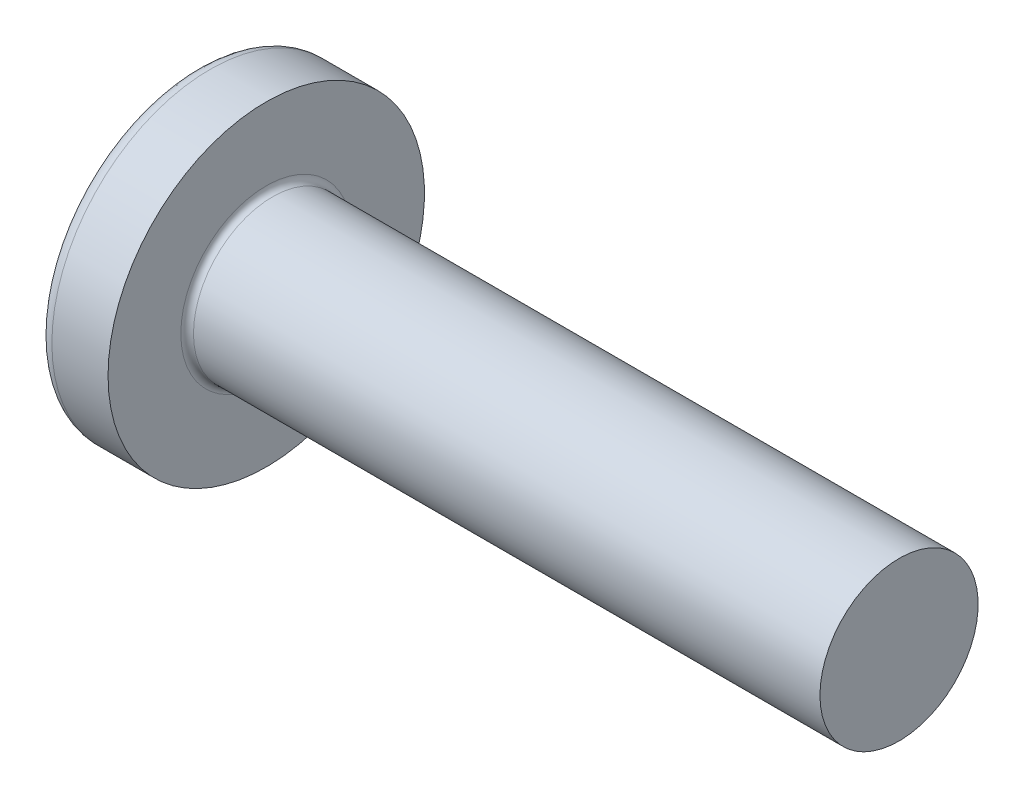
ISO-10303-21;
HEADER;
FILE_DESCRIPTION(('STEP AP214'),'2;1');
FILE_NAME('part.step','',(''),(''),'','','');
FILE_SCHEMA(('AUTOMOTIVE_DESIGN { 1 0 10303 214 1 1 1 1 }'));
ENDSEC;
DATA;
#1=APPLICATION_CONTEXT('core data for automotive mechanical design processes');
#2=APPLICATION_PROTOCOL_DEFINITION('international standard','automotive_design',2000,#1);
#3=PRODUCT_CONTEXT('',#1,'mechanical');
#4=PRODUCT('Part','Part','',(#3));
#5=PRODUCT_RELATED_PRODUCT_CATEGORY('part','',(#4));
#6=PRODUCT_DEFINITION_FORMATION('','',#4);
#7=PRODUCT_DEFINITION_CONTEXT('part definition',#1,'design');
#8=PRODUCT_DEFINITION('design','',#6,#7);
#9=PRODUCT_DEFINITION_SHAPE('','',#8);
#10=(LENGTH_UNIT() NAMED_UNIT(*) SI_UNIT(.MILLI.,.METRE.));
#11=(NAMED_UNIT(*) PLANE_ANGLE_UNIT() SI_UNIT($,.RADIAN.));
#12=(NAMED_UNIT(*) SI_UNIT($,.STERADIAN.) SOLID_ANGLE_UNIT());
#13=UNCERTAINTY_MEASURE_WITH_UNIT(LENGTH_MEASURE(1.E-05),#10,'distance_accuracy_value','');
#14=(GEOMETRIC_REPRESENTATION_CONTEXT(3) GLOBAL_UNCERTAINTY_ASSIGNED_CONTEXT((#13)) GLOBAL_UNIT_ASSIGNED_CONTEXT((#10,
#11,#12)) REPRESENTATION_CONTEXT('',''));
#15=CARTESIAN_POINT('',(0.,0.,0.));
#16=DIRECTION('',(0.,0.,1.));
#17=DIRECTION('',(1.,0.,0.));
#18=AXIS2_PLACEMENT_3D('',#15,#16,#17);
#19=CARTESIAN_POINT('',(16.,0.,0.));
#20=DIRECTION('',(-1.,0.,0.));
#21=DIRECTION('',(0.,1.,0.));
#22=AXIS2_PLACEMENT_3D('',#19,#20,#21);
#23=SPHERICAL_SURFACE('',#22,16.);
#24=CARTESIAN_POINT('',(3.23189799723057,0.,0.));
#25=DIRECTION('',(-1.,0.,0.));
#26=DIRECTION('',(0.,0.,1.));
#27=AXIS2_PLACEMENT_3D('',#24,#25,#26);
#28=CIRCLE('',#27,9.64238410596027);
#29=CARTESIAN_POINT('',(3.23189799723057,0.,9.64238410596027));
#30=VERTEX_POINT('',#29);
#31=EDGE_CURVE('E212',#30,#30,#28,.T.);
#32=ORIENTED_EDGE('',*,*,#31,.T.);
#33=EDGE_LOOP('',(#32));
#34=FACE_BOUND('',#33,.T.);
#35=CARTESIAN_POINT('',(0.168594787067849,0.,0.));
#36=DIRECTION('',(1.,0.,0.));
#37=DIRECTION('',(0.,0.,-1.));
#38=AXIS2_PLACEMENT_3D('',#35,#36,#37);
#39=CIRCLE('',#38,2.31659426398858);
#40=CARTESIAN_POINT('',(0.16859478706785,-1.07999999999999,-2.04944113941943));
#41=VERTEX_POINT('',#40);
#42=CARTESIAN_POINT('',(0.168594787067849,-2.04944113941942,-1.08));
#43=VERTEX_POINT('',#42);
#44=EDGE_CURVE('E338',#41,#43,#39,.F.);
#45=ORIENTED_EDGE('',*,*,#44,.F.);
#46=CARTESIAN_POINT('',(16.,-1.08,0.));
#47=DIRECTION('',(0.,1.,0.));
#48=DIRECTION('',(0.,0.,1.));
#49=AXIS2_PLACEMENT_3D('',#46,#47,#48);
#50=CIRCLE('',#49,15.9635083863166);
#51=CARTESIAN_POINT('',(0.712098426985781,-1.07999999999998,-4.59496088055484));
#52=VERTEX_POINT('',#51);
#53=EDGE_CURVE('E272',#52,#41,#50,.T.);
#54=ORIENTED_EDGE('',*,*,#53,.F.);
#55=CARTESIAN_POINT('',(14.7911437269581,0.,2.42459099107232));
#56=DIRECTION('',(0.446197753347436,0.,-0.894934391398443));
#57=DIRECTION('',(-0.894934391398443,0.,-0.446197753347436));
#58=AXIS2_PLACEMENT_3D('',#55,#56,#57);
#59=CIRCLE('',#58,15.7689576395251);
#60=CARTESIAN_POINT('',(0.712098426985781,1.08000000000002,-4.59496088055483));
#61=VERTEX_POINT('',#60);
#62=EDGE_CURVE('E246',#52,#61,#59,.T.);
#63=ORIENTED_EDGE('',*,*,#62,.T.);
#64=CARTESIAN_POINT('',(16.,1.08,0.));
#65=DIRECTION('',(0.,-1.,0.));
#66=DIRECTION('',(0.,0.,-1.));
#67=AXIS2_PLACEMENT_3D('',#64,#65,#66);
#68=CIRCLE('',#67,15.9635083863166);
#69=CARTESIAN_POINT('',(0.16859478706785,1.08000000000001,-2.04944113941942));
#70=VERTEX_POINT('',#69);
#71=EDGE_CURVE('E300',#70,#61,#68,.T.);
#72=ORIENTED_EDGE('',*,*,#71,.F.);
#73=CARTESIAN_POINT('',(0.168594787067849,2.04944113941941,-1.08));
#74=VERTEX_POINT('',#73);
#75=EDGE_CURVE('E353',#74,#70,#39,.F.);
#76=ORIENTED_EDGE('',*,*,#75,.F.);
#77=CARTESIAN_POINT('',(16.,0.,-1.08));
#78=DIRECTION('',(0.,0.,1.));
#79=DIRECTION('',(1.,0.,0.));
#80=AXIS2_PLACEMENT_3D('',#77,#78,#79);
#81=CIRCLE('',#80,15.9635083863166);
#82=CARTESIAN_POINT('',(0.71209842698578,4.59496088055484,-1.08));
#83=VERTEX_POINT('',#82);
#84=EDGE_CURVE('E240',#83,#74,#81,.T.);
#85=ORIENTED_EDGE('',*,*,#84,.F.);
#86=CARTESIAN_POINT('',(14.7911437269581,-2.42459099107232,0.));
#87=DIRECTION('',(0.446197753347436,0.894934391398443,0.));
#88=DIRECTION('',(-0.894934391398443,0.446197753347436,0.));
#89=AXIS2_PLACEMENT_3D('',#86,#87,#88);
#90=CIRCLE('',#89,15.7689576395251);
#91=CARTESIAN_POINT('',(0.71209842698578,4.59496088055484,1.08));
#92=VERTEX_POINT('',#91);
#93=EDGE_CURVE('E243',#83,#92,#90,.T.);
#94=ORIENTED_EDGE('',*,*,#93,.T.);
#95=CARTESIAN_POINT('',(16.,0.,1.08));
#96=DIRECTION('',(0.,0.,-1.));
#97=DIRECTION('',(0.,1.,0.));
#98=AXIS2_PLACEMENT_3D('',#95,#96,#97);
#99=CIRCLE('',#98,15.9635083863166);
#100=CARTESIAN_POINT('',(0.168594787067849,2.04944113941941,1.08));
#101=VERTEX_POINT('',#100);
#102=EDGE_CURVE('E236',#101,#92,#99,.T.);
#103=ORIENTED_EDGE('',*,*,#102,.F.);
#104=CARTESIAN_POINT('',(0.16859478706785,1.07999999999999,2.04944113941943));
#105=VERTEX_POINT('',#104);
#106=EDGE_CURVE('E352',#105,#101,#39,.F.);
#107=ORIENTED_EDGE('',*,*,#106,.F.);
#108=CARTESIAN_POINT('',(0.712098426985781,1.07999999999998,4.59496088055484));
#109=VERTEX_POINT('',#108);
#110=EDGE_CURVE('E256',#109,#105,#68,.T.);
#111=ORIENTED_EDGE('',*,*,#110,.F.);
#112=CARTESIAN_POINT('',(14.7911437269581,0.,-2.42459099107232));
#113=DIRECTION('',(0.446197753347436,0.,0.894934391398443));
#114=DIRECTION('',(0.894934391398443,0.,-0.446197753347436));
#115=AXIS2_PLACEMENT_3D('',#112,#113,#114);
#116=CIRCLE('',#115,15.7689576395251);
#117=CARTESIAN_POINT('',(0.712098426985781,-1.08000000000002,4.59496088055483));
#118=VERTEX_POINT('',#117);
#119=EDGE_CURVE('E47',#109,#118,#116,.T.);
#120=ORIENTED_EDGE('',*,*,#119,.T.);
#121=CARTESIAN_POINT('',(0.16859478706785,-1.08000000000001,2.04944113941943));
#122=VERTEX_POINT('',#121);
#123=EDGE_CURVE('E253',#122,#118,#50,.T.);
#124=ORIENTED_EDGE('',*,*,#123,.F.);
#125=CARTESIAN_POINT('',(0.168594787067849,-2.04944113941942,1.08));
#126=VERTEX_POINT('',#125);
#127=EDGE_CURVE('E384',#126,#122,#39,.F.);
#128=ORIENTED_EDGE('',*,*,#127,.F.);
#129=CARTESIAN_POINT('',(0.71209842698578,-4.59496088055483,1.08));
#130=VERTEX_POINT('',#129);
#131=EDGE_CURVE('E237',#130,#126,#99,.T.);
#132=ORIENTED_EDGE('',*,*,#131,.F.);
#133=CARTESIAN_POINT('',(14.7911437269581,2.42459099107232,0.));
#134=DIRECTION('',(0.446197753347436,-0.894934391398443,0.));
#135=DIRECTION('',(0.894934391398443,0.446197753347436,0.));
#136=AXIS2_PLACEMENT_3D('',#133,#134,#135);
#137=CIRCLE('',#136,15.7689576395251);
#138=CARTESIAN_POINT('',(0.71209842698578,-4.59496088055484,-1.08));
#139=VERTEX_POINT('',#138);
#140=EDGE_CURVE('E233',#130,#139,#137,.T.);
#141=ORIENTED_EDGE('',*,*,#140,.T.);
#142=EDGE_CURVE('E62',#43,#139,#81,.T.);
#143=ORIENTED_EDGE('',*,*,#142,.F.);
#144=EDGE_LOOP('',(#45,#54,#63,#72,#76,#85,#94,#103,#107,#111,#120,#124,#128,#132,#141,#143));
#145=FACE_BOUND('',#144,.T.);
#146=ADVANCED_FACE('F34',(#34,#145),#23,.T.);
#147=CARTESIAN_POINT('',(0.,4.94999999999999,-1.08));
#148=DIRECTION('',(0.,0.,1.));
#149=DIRECTION('',(1.,0.,0.));
#150=AXIS2_PLACEMENT_3D('',#147,#148,#149);
#151=PLANE('',#150);
#152=ORIENTED_EDGE('',*,*,#84,.T.);
#153=CARTESIAN_POINT('',(-3.43605311056389,2.33057774319368,-1.08));
#154=CARTESIAN_POINT('',(-2.73005788936149,2.27615518507628,-1.08));
#155=CARTESIAN_POINT('',(-2.02408650858328,2.22141913982355,-1.08));
#156=CARTESIAN_POINT('',(-0.612196178896327,2.11110719124856,-1.08));
#157=CARTESIAN_POINT('',(0.0937227687909008,2.05553127230215,-1.08));
#158=CARTESIAN_POINT('',(1.15253879223642,1.97137932907642,-1.08));
#159=CARTESIAN_POINT('',(1.50546717443926,1.94319732850324,-1.08));
#160=CARTESIAN_POINT('',(2.21129884226403,1.88653195912772,-1.08));
#161=CARTESIAN_POINT('',(2.56420212794819,1.85804859110097,-1.08));
#162=CARTESIAN_POINT('',(3.26997437360886,1.80073759682966,-1.08));
#163=CARTESIAN_POINT('',(3.62284333408858,1.77190997678611,-1.08));
#164=CARTESIAN_POINT('',(4.32855163516413,1.71385567830055,-1.08));
#165=CARTESIAN_POINT('',(4.68139097546501,1.68462899627166,-1.08));
#166=CARTESIAN_POINT('',(5.48196138691584,1.61778484426536,-1.08));
#167=CARTESIAN_POINT('',(5.92968063936628,1.5800255789917,-1.08));
#168=CARTESIAN_POINT('',(6.82503914618352,1.50358396776163,-1.08));
#169=CARTESIAN_POINT('',(7.27267840078262,1.46490162453115,-1.08));
#170=CARTESIAN_POINT('',(8.16783657307055,1.38637288862663,-1.08));
#171=CARTESIAN_POINT('',(8.6153554949306,1.34652654360286,-1.08));
#172=CARTESIAN_POINT('',(9.51026248486919,1.26532289179753,-1.08));
#173=CARTESIAN_POINT('',(9.95765055123334,1.22396556604181,-1.08));
#174=CARTESIAN_POINT('',(10.8523158736642,1.13920912306466,-1.08));
#175=CARTESIAN_POINT('',(11.2995930947875,1.09580963592832,-1.08));
#176=CARTESIAN_POINT('',(12.1938496891445,1.00615798148881,-1.08));
#177=CARTESIAN_POINT('',(12.6408290721386,0.959905912835485,-1.08));
#178=CARTESIAN_POINT('',(13.3109832262361,0.887238538031377,-1.08));
#179=CARTESIAN_POINT('',(13.5343356366705,0.862465479305158,-1.08));
#180=CARTESIAN_POINT('',(13.9808744583761,0.811493247434636,-1.08));
#181=CARTESIAN_POINT('',(14.204060872408,0.785294098569612,-1.08));
#182=CARTESIAN_POINT('',(14.6502320441495,0.730995725435139,-1.08));
#183=CARTESIAN_POINT('',(14.8732167746121,0.702896274763054,-1.08));
#184=CARTESIAN_POINT('',(15.2074339176581,0.658726299947166,-1.08));
#185=CARTESIAN_POINT('',(15.3187994773757,0.643665717094798,-1.08));
#186=CARTESIAN_POINT('',(15.5414149899271,0.612700054932443,-1.08));
#187=CARTESIAN_POINT('',(15.6526649406011,0.596794960123566,-1.08));
#188=CARTESIAN_POINT('',(15.7638416271016,0.580382331183072,-1.08));
#189=B_SPLINE_CURVE_WITH_KNOTS('',3,(#153,#154,#155,#156,#157,#158,#159,#160,#161,#162,#163,
#164,#165,#166,#167,#168,#169,#170,#171,#172,#173,#174,#175,#176,#177,#178,#179,#180,#181,#182,
#183,#184,#185,#186,#187,#188),.UNSPECIFIED.,.F.,.F.,(4,2,2,2,2,2,2,2,2,2,2,2,2,2,2,2,2,4),(0.,
2.12426964290659,4.24857885235091,5.3107341035929,6.37288662197896,7.43502003656715,
8.49716300414631,9.84508827634153,11.1930095684778,12.5408757584157,13.8887588800163,
15.2368871027213,16.5849687296847,17.2591314568035,17.9332827098455,18.6075144234906,
18.9446495011757,19.2817907682658),.UNSPECIFIED.);
#190=CARTESIAN_POINT('',(5.69,1.60013444747621,-1.08));
#191=VERTEX_POINT('',#190);
#192=EDGE_CURVE('E373',#74,#191,#189,.T.);
#193=ORIENTED_EDGE('',*,*,#192,.T.);
#194=DIRECTION('',(0.,1.,0.));
#195=VECTOR('',#194,1.);
#196=CARTESIAN_POINT('',(5.69,-2.11307112459984,-1.08));
#197=LINE('',#196,#195);
#198=CARTESIAN_POINT('',(5.69,2.11307112459984,-1.08));
#199=VERTEX_POINT('',#198);
#200=EDGE_CURVE('E321',#191,#199,#197,.T.);
#201=ORIENTED_EDGE('',*,*,#200,.T.);
#202=DIRECTION('',(0.894934391398442,-0.446197753347436,0.));
#203=VECTOR('',#202,1.);
#204=CARTESIAN_POINT('',(0.,4.95,-1.08));
#205=LINE('',#204,#203);
#206=EDGE_CURVE('E213',#83,#199,#205,.T.);
#207=ORIENTED_EDGE('',*,*,#206,.F.);
#208=EDGE_LOOP('',(#152,#193,#201,#207));
#209=FACE_BOUND('',#208,.T.);
#210=ADVANCED_FACE('F168',(#209),#151,.T.);
#211=CARTESIAN_POINT('',(5.69,-2.11307112459984,-1.08));
#212=VERTEX_POINT('',#211);
#213=CARTESIAN_POINT('',(5.69,-1.60013444747621,-1.08));
#214=VERTEX_POINT('',#213);
#215=EDGE_CURVE('E221',#212,#214,#197,.T.);
#216=ORIENTED_EDGE('',*,*,#215,.T.);
#217=CARTESIAN_POINT('',(-3.43605311056389,-2.33057774319368,-1.08));
#218=CARTESIAN_POINT('',(-2.73005788936149,-2.27615518507628,-1.08));
#219=CARTESIAN_POINT('',(-2.02408650858328,-2.22141913982355,-1.08));
#220=CARTESIAN_POINT('',(-0.612196178896327,-2.11110719124856,-1.08));
#221=CARTESIAN_POINT('',(0.0937227687909011,-2.05553127230214,-1.08));
#222=CARTESIAN_POINT('',(1.15253879223642,-1.97137932907642,-1.08));
#223=CARTESIAN_POINT('',(1.50546717443926,-1.94319732850324,-1.08));
#224=CARTESIAN_POINT('',(2.21129884226403,-1.88653195912772,-1.08));
#225=CARTESIAN_POINT('',(2.56420212794819,-1.85804859110097,-1.08));
#226=CARTESIAN_POINT('',(3.26997437360886,-1.80073759682966,-1.08));
#227=CARTESIAN_POINT('',(3.62284333408858,-1.77190997678611,-1.08));
#228=CARTESIAN_POINT('',(4.32855163516413,-1.71385567830055,-1.08));
#229=CARTESIAN_POINT('',(4.68139097546501,-1.68462899627166,-1.08));
#230=CARTESIAN_POINT('',(5.48196138691584,-1.61778484426536,-1.08));
#231=CARTESIAN_POINT('',(5.92968063936628,-1.5800255789917,-1.08));
#232=CARTESIAN_POINT('',(6.82503914618352,-1.50358396776163,-1.08));
#233=CARTESIAN_POINT('',(7.27267840078262,-1.46490162453115,-1.08));
#234=CARTESIAN_POINT('',(8.16783657307055,-1.38637288862663,-1.08));
#235=CARTESIAN_POINT('',(8.6153554949306,-1.34652654360286,-1.08));
#236=CARTESIAN_POINT('',(9.51026248486919,-1.26532289179753,-1.08));
#237=CARTESIAN_POINT('',(9.95765055123334,-1.22396556604181,-1.08));
#238=CARTESIAN_POINT('',(10.8523158736642,-1.13920912306466,-1.08));
#239=CARTESIAN_POINT('',(11.2995930947875,-1.09580963592832,-1.08));
#240=CARTESIAN_POINT('',(12.1938496891445,-1.00615798148881,-1.08));
#241=CARTESIAN_POINT('',(12.6408290721386,-0.959905912835485,-1.08));
#242=CARTESIAN_POINT('',(13.3109832262361,-0.887238538031376,-1.08));
#243=CARTESIAN_POINT('',(13.5343356366705,-0.862465479305157,-1.08));
#244=CARTESIAN_POINT('',(13.9808744583761,-0.811493247434636,-1.08));
#245=CARTESIAN_POINT('',(14.204060872408,-0.785294098569612,-1.08));
#246=CARTESIAN_POINT('',(14.6502320441495,-0.730995725435139,-1.08));
#247=CARTESIAN_POINT('',(14.8732167746121,-0.702896274763054,-1.08));
#248=CARTESIAN_POINT('',(15.2074339176582,-0.658726299947166,-1.08));
#249=CARTESIAN_POINT('',(15.3187994773757,-0.643665717094798,-1.08));
#250=CARTESIAN_POINT('',(15.5414149899271,-0.612700054932442,-1.08));
#251=CARTESIAN_POINT('',(15.6526649406011,-0.596794960123565,-1.08));
#252=CARTESIAN_POINT('',(15.7638416271017,-0.58038233118307,-1.08));
#253=B_SPLINE_CURVE_WITH_KNOTS('',3,(#217,#218,#219,#220,#221,#222,#223,#224,#225,#226,#227,
#228,#229,#230,#231,#232,#233,#234,#235,#236,#237,#238,#239,#240,#241,#242,#243,#244,#245,#246,
#247,#248,#249,#250,#251,#252),.UNSPECIFIED.,.F.,.F.,(4,2,2,2,2,2,2,2,2,2,2,2,2,2,2,2,2,4),(0.,
2.12426964290659,4.24857885235091,5.3107341035929,6.37288662197896,7.43502003656715,
8.49716300414631,9.84508827634152,11.1930095684778,12.5408757584157,13.8887588800163,
15.2368871027213,16.5849687296847,17.2591314568035,17.9332827098455,18.6075144234906,
18.9446495011757,19.2817907682658),.UNSPECIFIED.);
#254=EDGE_CURVE('E351',#214,#43,#253,.F.);
#255=ORIENTED_EDGE('',*,*,#254,.T.);
#256=ORIENTED_EDGE('',*,*,#142,.T.);
#257=DIRECTION('',(0.894934391398442,0.446197753347436,0.));
#258=VECTOR('',#257,1.);
#259=CARTESIAN_POINT('',(0.,-4.95,-1.08));
#260=LINE('',#259,#258);
#261=EDGE_CURVE('E303',#139,#212,#260,.T.);
#262=ORIENTED_EDGE('',*,*,#261,.T.);
#263=EDGE_LOOP('',(#216,#255,#256,#262));
#264=FACE_BOUND('',#263,.T.);
#265=ADVANCED_FACE('F174',(#264),#151,.T.);
#266=CARTESIAN_POINT('',(0.,-4.94999999999999,1.08));
#267=DIRECTION('',(0.,0.,-1.));
#268=DIRECTION('',(0.,1.,0.));
#269=AXIS2_PLACEMENT_3D('',#266,#267,#268);
#270=PLANE('',#269);
#271=DIRECTION('',(0.,-1.,0.));
#272=VECTOR('',#271,1.);
#273=CARTESIAN_POINT('',(5.69,2.11307112459984,1.08));
#274=LINE('',#273,#272);
#275=CARTESIAN_POINT('',(5.69,2.11307112459984,1.08));
#276=VERTEX_POINT('',#275);
#277=CARTESIAN_POINT('',(5.69,1.60013444747621,1.08));
#278=VERTEX_POINT('',#277);
#279=EDGE_CURVE('E311',#276,#278,#274,.T.);
#280=ORIENTED_EDGE('',*,*,#279,.T.);
#281=CARTESIAN_POINT('',(-3.43605312354531,2.33057774419416,1.08));
#282=CARTESIAN_POINT('',(-2.73005790068362,2.27615518595292,1.08));
#283=CARTESIAN_POINT('',(-2.02408651824618,2.22141914057536,1.08));
#284=CARTESIAN_POINT('',(-0.612196185240834,2.11110719174749,1.08));
#285=CARTESIAN_POINT('',(0.0937227641055553,2.055531272673,1.08));
#286=CARTESIAN_POINT('',(1.15253879056997,1.97137932920962,1.08));
#287=CARTESIAN_POINT('',(1.50546717413264,1.94319732852816,1.08));
#288=CARTESIAN_POINT('',(2.21129884467686,1.88653195893371,1.08));
#289=CARTESIAN_POINT('',(2.56420213172064,1.85804859079632,1.08));
#290=CARTESIAN_POINT('',(3.26997438010022,1.80073759630085,1.08));
#291=CARTESIAN_POINT('',(3.62284334193923,1.77190997614379,1.08));
#292=CARTESIAN_POINT('',(4.32855164573311,1.7138556774276,1.08));
#293=CARTESIAN_POINT('',(4.68139098739302,1.68462899528161,1.08));
#294=CARTESIAN_POINT('',(5.48196140020257,1.61778484314849,1.08));
#295=CARTESIAN_POINT('',(5.92968065265283,1.58002557786661,1.08));
#296=CARTESIAN_POINT('',(6.82503915946948,1.50358396661807,1.08));
#297=CARTESIAN_POINT('',(7.27267841406819,1.46490162337736,1.08));
#298=CARTESIAN_POINT('',(8.16783658635485,1.38637288744954,1.08));
#299=CARTESIAN_POINT('',(8.61535550821404,1.34652654241272,1.08));
#300=CARTESIAN_POINT('',(9.51026249815054,1.26532289057715,1.08));
#301=CARTESIAN_POINT('',(9.95765056451348,1.22396556480425,1.08));
#302=CARTESIAN_POINT('',(10.8523158869419,1.13920912178625,1.08));
#303=CARTESIAN_POINT('',(11.299593108064,1.09580963462624,1.08));
#304=CARTESIAN_POINT('',(12.1938497024173,1.0061579801289,1.08));
#305=CARTESIAN_POINT('',(12.6408290854088,0.959905911441418,1.08));
#306=CARTESIAN_POINT('',(13.3109832395008,0.887238536570858,1.08));
#307=CARTESIAN_POINT('',(13.5343356499334,0.862465477819925,1.08));
#308=CARTESIAN_POINT('',(13.9808744716342,0.811493245892373,1.08));
#309=CARTESIAN_POINT('',(14.2040608856631,0.785294096995033,1.08));
#310=CARTESIAN_POINT('',(14.6502320573974,0.730995723784125,1.08));
#311=CARTESIAN_POINT('',(14.8732167878556,0.702896273067916,1.08));
#312=CARTESIAN_POINT('',(15.2074339308928,0.658726298170583,1.08));
#313=CARTESIAN_POINT('',(15.318799490607,0.643665715288515,1.08));
#314=CARTESIAN_POINT('',(15.5414150031506,0.612700053059412,1.08));
#315=CARTESIAN_POINT('',(15.65266495382,0.596794958213487,1.08));
#316=CARTESIAN_POINT('',(15.7638416403152,0.580382329231145,1.08));
#317=B_SPLINE_CURVE_WITH_KNOTS('',3,(#281,#282,#283,#284,#285,#286,#287,#288,#289,#290,#291,
#292,#293,#294,#295,#296,#297,#298,#299,#300,#301,#302,#303,#304,#305,#306,#307,#308,#309,#310,
#311,#312,#313,#314,#315,#316),.UNSPECIFIED.,.F.,.F.,(4,2,2,2,2,2,2,2,2,2,2,2,2,2,2,2,2,4),(0.,
2.12426964789832,4.24857886233492,5.3107341176693,6.37288664014772,7.43502005882796,
8.49716303049931,9.84508830269604,11.1930095948338,12.5408757847726,13.8887589063742,
15.2368871290825,16.5849687560486,17.25913148317,17.9332827362145,18.607514449863,
18.9446495275502,19.2817907946425),.UNSPECIFIED.);
#318=EDGE_CURVE('E277',#278,#101,#317,.F.);
#319=ORIENTED_EDGE('',*,*,#318,.T.);
#320=ORIENTED_EDGE('',*,*,#102,.T.);
#321=DIRECTION('',(0.894934391398442,-0.446197753347436,0.));
#322=VECTOR('',#321,1.);
#323=CARTESIAN_POINT('',(0.,4.95,1.08));
#324=LINE('',#323,#322);
#325=EDGE_CURVE('E218',#92,#276,#324,.T.);
#326=ORIENTED_EDGE('',*,*,#325,.T.);
#327=EDGE_LOOP('',(#280,#319,#320,#326));
#328=FACE_BOUND('',#327,.T.);
#329=ADVANCED_FACE('F369',(#328),#270,.T.);
#330=ORIENTED_EDGE('',*,*,#131,.T.);
#331=CARTESIAN_POINT('',(-3.43605312354531,-2.33057774419416,1.08));
#332=CARTESIAN_POINT('',(-2.73005790068362,-2.27615518595292,1.08));
#333=CARTESIAN_POINT('',(-2.02408651824618,-2.22141914057536,1.08));
#334=CARTESIAN_POINT('',(-0.612196185240835,-2.11110719174749,1.08));
#335=CARTESIAN_POINT('',(0.0937227641055548,-2.055531272673,1.08));
#336=CARTESIAN_POINT('',(1.15253879056997,-1.97137932920962,1.08));
#337=CARTESIAN_POINT('',(1.50546717413264,-1.94319732852816,1.08));
#338=CARTESIAN_POINT('',(2.21129884467686,-1.88653195893371,1.08));
#339=CARTESIAN_POINT('',(2.56420213172064,-1.85804859079632,1.08));
#340=CARTESIAN_POINT('',(3.26997438010022,-1.80073759630085,1.08));
#341=CARTESIAN_POINT('',(3.62284334193923,-1.77190997614379,1.08));
#342=CARTESIAN_POINT('',(4.32855164573311,-1.7138556774276,1.08));
#343=CARTESIAN_POINT('',(4.68139098739302,-1.68462899528161,1.08));
#344=CARTESIAN_POINT('',(5.48196140020257,-1.61778484314849,1.08));
#345=CARTESIAN_POINT('',(5.92968065265283,-1.58002557786661,1.08));
#346=CARTESIAN_POINT('',(6.82503915946948,-1.50358396661807,1.08));
#347=CARTESIAN_POINT('',(7.27267841406818,-1.46490162337736,1.08));
#348=CARTESIAN_POINT('',(8.16783658635484,-1.38637288744954,1.08));
#349=CARTESIAN_POINT('',(8.61535550821403,-1.34652654241272,1.08));
#350=CARTESIAN_POINT('',(9.51026249815053,-1.26532289057715,1.08));
#351=CARTESIAN_POINT('',(9.95765056451346,-1.22396556480425,1.08));
#352=CARTESIAN_POINT('',(10.8523158869419,-1.13920912178625,1.08));
#353=CARTESIAN_POINT('',(11.299593108064,-1.09580963462624,1.08));
#354=CARTESIAN_POINT('',(12.1938497024173,-1.0061579801289,1.08));
#355=CARTESIAN_POINT('',(12.6408290854088,-0.959905911441419,1.08));
#356=CARTESIAN_POINT('',(13.3109832395008,-0.887238536570858,1.08));
#357=CARTESIAN_POINT('',(13.5343356499334,-0.862465477819925,1.08));
#358=CARTESIAN_POINT('',(13.9808744716342,-0.811493245892374,1.08));
#359=CARTESIAN_POINT('',(14.2040608856631,-0.785294096995035,1.08));
#360=CARTESIAN_POINT('',(14.6502320573974,-0.730995723784126,1.08));
#361=CARTESIAN_POINT('',(14.8732167878556,-0.702896273067916,1.08));
#362=CARTESIAN_POINT('',(15.2074339308928,-0.658726298170583,1.08));
#363=CARTESIAN_POINT('',(15.318799490607,-0.643665715288516,1.08));
#364=CARTESIAN_POINT('',(15.5414150031506,-0.612700053059414,1.08));
#365=CARTESIAN_POINT('',(15.65266495382,-0.596794958213489,1.08));
#366=CARTESIAN_POINT('',(15.7638416403152,-0.580382329231146,1.08));
#367=B_SPLINE_CURVE_WITH_KNOTS('',3,(#331,#332,#333,#334,#335,#336,#337,#338,#339,#340,#341,
#342,#343,#344,#345,#346,#347,#348,#349,#350,#351,#352,#353,#354,#355,#356,#357,#358,#359,#360,
#361,#362,#363,#364,#365,#366),.UNSPECIFIED.,.F.,.F.,(4,2,2,2,2,2,2,2,2,2,2,2,2,2,2,2,2,4),(0.,
2.12426964789832,4.24857886233492,5.31073411766931,6.37288664014773,7.43502005882796,
8.49716303049931,9.84508830269603,11.1930095948338,12.5408757847726,13.8887589063742,
15.2368871290825,16.5849687560486,17.25913148317,17.9332827362145,18.607514449863,
18.9446495275502,19.2817907946425),.UNSPECIFIED.);
#368=CARTESIAN_POINT('',(5.69,-1.60013444747621,1.08));
#369=VERTEX_POINT('',#368);
#370=EDGE_CURVE('E385',#126,#369,#367,.T.);
#371=ORIENTED_EDGE('',*,*,#370,.T.);
#372=CARTESIAN_POINT('',(5.69,-2.11307112459984,1.08));
#373=VERTEX_POINT('',#372);
#374=EDGE_CURVE('E313',#369,#373,#274,.T.);
#375=ORIENTED_EDGE('',*,*,#374,.T.);
#376=DIRECTION('',(0.894934391398442,0.446197753347436,0.));
#377=VECTOR('',#376,1.);
#378=CARTESIAN_POINT('',(0.,-4.95,1.08));
#379=LINE('',#378,#377);
#380=EDGE_CURVE('E305',#130,#373,#379,.T.);
#381=ORIENTED_EDGE('',*,*,#380,.F.);
#382=EDGE_LOOP('',(#330,#371,#375,#381));
#383=FACE_BOUND('',#382,.T.);
#384=ADVANCED_FACE('F414',(#383),#270,.T.);
#385=CARTESIAN_POINT('',(5.69,2.11307112459984,-1.08));
#386=DIRECTION('',(-1.,0.,0.));
#387=DIRECTION('',(0.,0.,1.));
#388=AXIS2_PLACEMENT_3D('',#385,#386,#387);
#389=PLANE('',#388);
#390=ORIENTED_EDGE('',*,*,#374,.F.);
#391=CARTESIAN_POINT('',(5.69,0.,0.));
#392=DIRECTION('',(-1.,0.,0.));
#393=DIRECTION('',(0.,0.,1.));
#394=AXIS2_PLACEMENT_3D('',#391,#392,#393);
#395=CIRCLE('',#394,1.9305);
#396=EDGE_CURVE('E346',#214,#369,#395,.T.);
#397=ORIENTED_EDGE('',*,*,#396,.F.);
#398=ORIENTED_EDGE('',*,*,#215,.F.);
#399=DIRECTION('',(0.,0.,1.));
#400=VECTOR('',#399,1.);
#401=CARTESIAN_POINT('',(5.69,-2.11307112459984,-1.08));
#402=LINE('',#401,#400);
#403=EDGE_CURVE('E308',#212,#373,#402,.T.);
#404=ORIENTED_EDGE('',*,*,#403,.T.);
#405=EDGE_LOOP('',(#390,#397,#398,#404));
#406=FACE_BOUND('',#405,.T.);
#407=ADVANCED_FACE('F407',(#406),#389,.T.);
#408=DIRECTION('',(0.,0.,-1.));
#409=VECTOR('',#408,1.);
#410=CARTESIAN_POINT('',(5.69,-1.08000000000001,2.11307112459984));
#411=LINE('',#410,#409);
#412=CARTESIAN_POINT('',(5.69,-1.07999999999999,-1.60013444747621));
#413=VERTEX_POINT('',#412);
#414=CARTESIAN_POINT('',(5.69,-1.07999999999999,-2.11307112459984));
#415=VERTEX_POINT('',#414);
#416=EDGE_CURVE('E294',#413,#415,#411,.T.);
#417=ORIENTED_EDGE('',*,*,#416,.F.);
#418=CARTESIAN_POINT('',(5.69,1.08000000000001,-1.60013444747621));
#419=VERTEX_POINT('',#418);
#420=EDGE_CURVE('E54',#419,#413,#395,.T.);
#421=ORIENTED_EDGE('',*,*,#420,.F.);
#422=DIRECTION('',(0.,0.,1.));
#423=VECTOR('',#422,1.);
#424=CARTESIAN_POINT('',(5.69,1.08000000000001,-2.11307112459984));
#425=LINE('',#424,#423);
#426=CARTESIAN_POINT('',(5.69,1.08000000000001,-2.11307112459984));
#427=VERTEX_POINT('',#426);
#428=EDGE_CURVE('E297',#427,#419,#425,.T.);
#429=ORIENTED_EDGE('',*,*,#428,.F.);
#430=DIRECTION('',(0.,-1.,0.));
#431=VECTOR('',#430,1.);
#432=CARTESIAN_POINT('',(5.69,1.08000000000001,-2.11307112459984));
#433=LINE('',#432,#431);
#434=EDGE_CURVE('E288',#427,#415,#433,.T.);
#435=ORIENTED_EDGE('',*,*,#434,.T.);
#436=EDGE_LOOP('',(#417,#421,#429,#435));
#437=FACE_BOUND('',#436,.T.);
#438=ADVANCED_FACE('F341',(#437),#389,.T.);
#439=ORIENTED_EDGE('',*,*,#200,.F.);
#440=EDGE_CURVE('E345',#278,#191,#395,.T.);
#441=ORIENTED_EDGE('',*,*,#440,.F.);
#442=ORIENTED_EDGE('',*,*,#279,.F.);
#443=DIRECTION('',(0.,0.,-1.));
#444=VECTOR('',#443,1.);
#445=CARTESIAN_POINT('',(5.69,2.11307112459984,1.08));
#446=LINE('',#445,#444);
#447=EDGE_CURVE('E314',#276,#199,#446,.T.);
#448=ORIENTED_EDGE('',*,*,#447,.T.);
#449=EDGE_LOOP('',(#439,#441,#442,#448));
#450=FACE_BOUND('',#449,.T.);
#451=ADVANCED_FACE('F408',(#450),#389,.T.);
#452=CARTESIAN_POINT('',(0.,1.07999999999998,4.95));
#453=DIRECTION('',(0.,-1.,0.));
#454=DIRECTION('',(1.,0.,0.));
#455=AXIS2_PLACEMENT_3D('',#452,#453,#454);
#456=PLANE('',#455);
#457=ORIENTED_EDGE('',*,*,#110,.T.);
#458=CARTESIAN_POINT('',(-3.43605312354531,1.07999999999999,2.33057774419416));
#459=CARTESIAN_POINT('',(-2.73005790068362,1.07999999999999,2.27615518595292));
#460=CARTESIAN_POINT('',(-2.02408651824618,1.07999999999999,2.22141914057537));
#461=CARTESIAN_POINT('',(-0.612196185240833,1.07999999999999,2.11110719174749));
#462=CARTESIAN_POINT('',(0.0937227641055562,1.07999999999999,2.05553127267301));
#463=CARTESIAN_POINT('',(1.15253879056997,1.07999999999999,1.97137932920963));
#464=CARTESIAN_POINT('',(1.50546717413264,1.07999999999999,1.94319732852816));
#465=CARTESIAN_POINT('',(2.21129884467686,1.07999999999999,1.88653195893372));
#466=CARTESIAN_POINT('',(2.56420213172064,1.07999999999999,1.85804859079632));
#467=CARTESIAN_POINT('',(3.26997438010022,1.07999999999999,1.80073759630085));
#468=CARTESIAN_POINT('',(3.62284334193923,1.07999999999999,1.77190997614379));
#469=CARTESIAN_POINT('',(4.32855164573311,1.07999999999999,1.7138556774276));
#470=CARTESIAN_POINT('',(4.68139098739302,1.07999999999999,1.68462899528162));
#471=CARTESIAN_POINT('',(5.48196140020257,1.07999999999999,1.61778484314849));
#472=CARTESIAN_POINT('',(5.92968065265283,1.07999999999999,1.58002557786661));
#473=CARTESIAN_POINT('',(6.82503915946948,1.07999999999999,1.50358396661808));
#474=CARTESIAN_POINT('',(7.27267841406819,1.07999999999999,1.46490162337736));
#475=CARTESIAN_POINT('',(8.16783658635484,1.08,1.38637288744955));
#476=CARTESIAN_POINT('',(8.61535550821403,1.08,1.34652654241272));
#477=CARTESIAN_POINT('',(9.51026249815054,1.08,1.26532289057715));
#478=CARTESIAN_POINT('',(9.95765056451347,1.08,1.22396556480425));
#479=CARTESIAN_POINT('',(10.8523158869419,1.08,1.13920912178626));
#480=CARTESIAN_POINT('',(11.299593108064,1.08,1.09580963462625));
#481=CARTESIAN_POINT('',(12.1938497024173,1.08,1.0061579801289));
#482=CARTESIAN_POINT('',(12.6408290854088,1.08,0.959905911441422));
#483=CARTESIAN_POINT('',(13.3109832395008,1.08,0.887238536570863));
#484=CARTESIAN_POINT('',(13.5343356499333,1.08,0.86246547781993));
#485=CARTESIAN_POINT('',(13.9808744716342,1.08,0.811493245892379));
#486=CARTESIAN_POINT('',(14.2040608856631,1.08,0.785294096995039));
#487=CARTESIAN_POINT('',(14.6502320573974,1.08,0.73099572378413));
#488=CARTESIAN_POINT('',(14.8732167878556,1.08,0.70289627306792));
#489=CARTESIAN_POINT('',(15.2074339308928,1.08,0.658726298170587));
#490=CARTESIAN_POINT('',(15.318799490607,1.08,0.64366571528852));
#491=CARTESIAN_POINT('',(15.5414150031506,1.08,0.612700053059418));
#492=CARTESIAN_POINT('',(15.65266495382,1.08,0.596794958213493));
#493=CARTESIAN_POINT('',(15.7638416403152,1.08,0.58038232923115));
#494=B_SPLINE_CURVE_WITH_KNOTS('',3,(#458,#459,#460,#461,#462,#463,#464,#465,#466,#467,#468,
#469,#470,#471,#472,#473,#474,#475,#476,#477,#478,#479,#480,#481,#482,#483,#484,#485,#486,#487,
#488,#489,#490,#491,#492,#493),.UNSPECIFIED.,.F.,.F.,(4,2,2,2,2,2,2,2,2,2,2,2,2,2,2,2,2,4),(0.,
2.12426964789832,4.24857886233492,5.3107341176693,6.37288664014772,7.43502005882796,
8.49716303049931,9.84508830269604,11.1930095948338,12.5408757847726,13.8887589063742,
15.2368871290825,16.5849687560486,17.25913148317,17.9332827362145,18.607514449863,
18.9446495275502,19.2817907946425),.UNSPECIFIED.);
#495=CARTESIAN_POINT('',(5.69,1.07999999999999,1.60013444747621));
#496=VERTEX_POINT('',#495);
#497=EDGE_CURVE('E432',#105,#496,#494,.T.);
#498=ORIENTED_EDGE('',*,*,#497,.T.);
#499=CARTESIAN_POINT('',(5.69,1.07999999999999,2.11307112459984));
#500=VERTEX_POINT('',#499);
#501=EDGE_CURVE('E270',#496,#500,#425,.T.);
#502=ORIENTED_EDGE('',*,*,#501,.T.);
#503=DIRECTION('',(0.894934391398442,0.,-0.446197753347436));
#504=VECTOR('',#503,1.);
#505=CARTESIAN_POINT('',(0.,1.07999999999998,4.95));
#506=LINE('',#505,#504);
#507=EDGE_CURVE('E263',#109,#500,#506,.T.);
#508=ORIENTED_EDGE('',*,*,#507,.F.);
#509=EDGE_LOOP('',(#457,#498,#502,#508));
#510=FACE_BOUND('',#509,.T.);
#511=ADVANCED_FACE('F267',(#510),#456,.T.);
#512=CARTESIAN_POINT('',(0.,-1.07999999999998,-4.95));
#513=DIRECTION('',(0.,1.,0.));
#514=DIRECTION('',(0.,0.,1.));
#515=AXIS2_PLACEMENT_3D('',#512,#513,#514);
#516=PLANE('',#515);
#517=CARTESIAN_POINT('',(5.69,-1.08000000000001,2.11307112459984));
#518=VERTEX_POINT('',#517);
#519=CARTESIAN_POINT('',(5.69,-1.08000000000001,1.60013444747621));
#520=VERTEX_POINT('',#519);
#521=EDGE_CURVE('E291',#518,#520,#411,.T.);
#522=ORIENTED_EDGE('',*,*,#521,.T.);
#523=CARTESIAN_POINT('',(-3.43605312354531,-1.08000000000001,2.33057774419416));
#524=CARTESIAN_POINT('',(-2.73005790068362,-1.08000000000001,2.27615518595292));
#525=CARTESIAN_POINT('',(-2.02408651824618,-1.08000000000001,2.22141914057536));
#526=CARTESIAN_POINT('',(-0.612196185240834,-1.08000000000001,2.11110719174748));
#527=CARTESIAN_POINT('',(0.0937227641055557,-1.08000000000001,2.055531272673));
#528=CARTESIAN_POINT('',(1.15253879056997,-1.08000000000001,1.97137932920962));
#529=CARTESIAN_POINT('',(1.50546717413264,-1.08000000000001,1.94319732852816));
#530=CARTESIAN_POINT('',(2.21129884467686,-1.08000000000001,1.88653195893371));
#531=CARTESIAN_POINT('',(2.56420213172064,-1.08000000000001,1.85804859079632));
#532=CARTESIAN_POINT('',(3.26997438010022,-1.08000000000001,1.80073759630084));
#533=CARTESIAN_POINT('',(3.62284334193923,-1.08000000000001,1.77190997614378));
#534=CARTESIAN_POINT('',(4.32855164573311,-1.08000000000001,1.7138556774276));
#535=CARTESIAN_POINT('',(4.68139098739302,-1.08000000000001,1.68462899528161));
#536=CARTESIAN_POINT('',(5.48196140020257,-1.08000000000001,1.61778484314848));
#537=CARTESIAN_POINT('',(5.92968065265283,-1.08000000000001,1.5800255778666));
#538=CARTESIAN_POINT('',(6.82503915946948,-1.08000000000001,1.50358396661807));
#539=CARTESIAN_POINT('',(7.27267841406819,-1.08000000000001,1.46490162337735));
#540=CARTESIAN_POINT('',(8.16783658635484,-1.08,1.38637288744954));
#541=CARTESIAN_POINT('',(8.61535550821403,-1.08,1.34652654241272));
#542=CARTESIAN_POINT('',(9.51026249815054,-1.08,1.26532289057715));
#543=CARTESIAN_POINT('',(9.95765056451347,-1.08,1.22396556480424));
#544=CARTESIAN_POINT('',(10.8523158869419,-1.08,1.13920912178625));
#545=CARTESIAN_POINT('',(11.299593108064,-1.08,1.09580963462624));
#546=CARTESIAN_POINT('',(12.1938497024173,-1.08,1.0061579801289));
#547=CARTESIAN_POINT('',(12.6408290854088,-1.08,0.959905911441415));
#548=CARTESIAN_POINT('',(13.3109832395008,-1.08,0.887238536570855));
#549=CARTESIAN_POINT('',(13.5343356499334,-1.08,0.862465477819922));
#550=CARTESIAN_POINT('',(13.9808744716342,-1.08,0.81149324589237));
#551=CARTESIAN_POINT('',(14.2040608856631,-1.08,0.785294096995031));
#552=CARTESIAN_POINT('',(14.6502320573974,-1.08,0.730995723784122));
#553=CARTESIAN_POINT('',(14.8732167878556,-1.08,0.702896273067913));
#554=CARTESIAN_POINT('',(15.2074339308928,-1.08,0.65872629817058));
#555=CARTESIAN_POINT('',(15.318799490607,-1.08,0.643665715288512));
#556=CARTESIAN_POINT('',(15.5414150031506,-1.08,0.612700053059409));
#557=CARTESIAN_POINT('',(15.65266495382,-1.08,0.596794958213485));
#558=CARTESIAN_POINT('',(15.7638416403152,-1.08,0.580382329231142));
#559=B_SPLINE_CURVE_WITH_KNOTS('',3,(#523,#524,#525,#526,#527,#528,#529,#530,#531,#532,#533,
#534,#535,#536,#537,#538,#539,#540,#541,#542,#543,#544,#545,#546,#547,#548,#549,#550,#551,#552,
#553,#554,#555,#556,#557,#558),.UNSPECIFIED.,.F.,.F.,(4,2,2,2,2,2,2,2,2,2,2,2,2,2,2,2,2,4),(0.,
2.12426964789832,4.24857886233492,5.3107341176693,6.37288664014772,7.43502005882796,
8.49716303049931,9.84508830269603,11.1930095948338,12.5408757847726,13.8887589063742,
15.2368871290825,16.5849687560486,17.25913148317,17.9332827362145,18.607514449863,
18.9446495275502,19.2817907946425),.UNSPECIFIED.);
#560=EDGE_CURVE('E378',#520,#122,#559,.F.);
#561=ORIENTED_EDGE('',*,*,#560,.T.);
#562=ORIENTED_EDGE('',*,*,#123,.T.);
#563=DIRECTION('',(0.894934391398442,0.,-0.446197753347436));
#564=VECTOR('',#563,1.);
#565=CARTESIAN_POINT('',(0.,-1.08000000000002,4.95));
#566=LINE('',#565,#564);
#567=EDGE_CURVE('E265',#118,#518,#566,.T.);
#568=ORIENTED_EDGE('',*,*,#567,.T.);
#569=EDGE_LOOP('',(#522,#561,#562,#568));
#570=FACE_BOUND('',#569,.T.);
#571=ADVANCED_FACE('F203',(#570),#516,.T.);
#572=ORIENTED_EDGE('',*,*,#428,.T.);
#573=CARTESIAN_POINT('',(-3.43605311056389,1.08000000000001,-2.33057774319368));
#574=CARTESIAN_POINT('',(-2.73005788936149,1.08000000000001,-2.27615518507628));
#575=CARTESIAN_POINT('',(-2.02408650858328,1.08000000000001,-2.22141913982354));
#576=CARTESIAN_POINT('',(-0.612196178896328,1.08000000000001,-2.11110719124855));
#577=CARTESIAN_POINT('',(0.0937227687909005,1.08000000000001,-2.05553127230214));
#578=CARTESIAN_POINT('',(1.15253879223642,1.08000000000001,-1.97137932907642));
#579=CARTESIAN_POINT('',(1.50546717443926,1.08000000000001,-1.94319732850324));
#580=CARTESIAN_POINT('',(2.21129884226403,1.08000000000001,-1.88653195912772));
#581=CARTESIAN_POINT('',(2.56420212794819,1.08000000000001,-1.85804859110096));
#582=CARTESIAN_POINT('',(3.26997437360885,1.08000000000001,-1.80073759682965));
#583=CARTESIAN_POINT('',(3.62284333408858,1.08000000000001,-1.77190997678611));
#584=CARTESIAN_POINT('',(4.32855163516413,1.08000000000001,-1.71385567830054));
#585=CARTESIAN_POINT('',(4.68139097546501,1.08000000000001,-1.68462899627166));
#586=CARTESIAN_POINT('',(5.48196138691584,1.08000000000001,-1.61778484426536));
#587=CARTESIAN_POINT('',(5.92968063936628,1.08000000000001,-1.5800255789917));
#588=CARTESIAN_POINT('',(6.82503914618352,1.08000000000001,-1.50358396776162));
#589=CARTESIAN_POINT('',(7.27267840078262,1.08000000000001,-1.46490162453115));
#590=CARTESIAN_POINT('',(8.16783657307055,1.08,-1.38637288862663));
#591=CARTESIAN_POINT('',(8.61535549493061,1.08,-1.34652654360286));
#592=CARTESIAN_POINT('',(9.51026248486919,1.08,-1.26532289179753));
#593=CARTESIAN_POINT('',(9.95765055123335,1.08,-1.22396556604181));
#594=CARTESIAN_POINT('',(10.8523158736642,1.08,-1.13920912306466));
#595=CARTESIAN_POINT('',(11.2995930947875,1.08,-1.09580963592832));
#596=CARTESIAN_POINT('',(12.1938496891445,1.08,-1.0061579814888));
#597=CARTESIAN_POINT('',(12.6408290721386,1.08,-0.959905912835482));
#598=CARTESIAN_POINT('',(13.3109832262361,1.08,-0.887238538031373));
#599=CARTESIAN_POINT('',(13.5343356366705,1.08,-0.862465479305154));
#600=CARTESIAN_POINT('',(13.9808744583761,1.08,-0.811493247434633));
#601=CARTESIAN_POINT('',(14.204060872408,1.08,-0.785294098569609));
#602=CARTESIAN_POINT('',(14.6502320441495,1.08,-0.730995725435136));
#603=CARTESIAN_POINT('',(14.8732167746121,1.08,-0.702896274763051));
#604=CARTESIAN_POINT('',(15.2074339176581,1.08,-0.658726299947162));
#605=CARTESIAN_POINT('',(15.3187994773757,1.08,-0.643665717094794));
#606=CARTESIAN_POINT('',(15.5414149899271,1.08,-0.612700054932439));
#607=CARTESIAN_POINT('',(15.6526649406011,1.08,-0.596794960123562));
#608=CARTESIAN_POINT('',(15.7638416271016,1.08,-0.580382331183068));
#609=B_SPLINE_CURVE_WITH_KNOTS('',3,(#573,#574,#575,#576,#577,#578,#579,#580,#581,#582,#583,
#584,#585,#586,#587,#588,#589,#590,#591,#592,#593,#594,#595,#596,#597,#598,#599,#600,#601,#602,
#603,#604,#605,#606,#607,#608),.UNSPECIFIED.,.F.,.F.,(4,2,2,2,2,2,2,2,2,2,2,2,2,2,2,2,2,4),(0.,
2.12426964290659,4.24857885235091,5.3107341035929,6.37288662197896,7.43502003656715,
8.49716300414631,9.84508827634153,11.1930095684778,12.5408757584157,13.8887588800163,
15.2368871027213,16.5849687296847,17.2591314568035,17.9332827098455,18.6075144234906,
18.9446495011757,19.2817907682658),.UNSPECIFIED.);
#610=EDGE_CURVE('E330',#419,#70,#609,.F.);
#611=ORIENTED_EDGE('',*,*,#610,.T.);
#612=ORIENTED_EDGE('',*,*,#71,.T.);
#613=DIRECTION('',(0.894934391398442,0.,0.446197753347436));
#614=VECTOR('',#613,1.);
#615=CARTESIAN_POINT('',(0.,1.08000000000002,-4.95));
#616=LINE('',#615,#614);
#617=EDGE_CURVE('E274',#61,#427,#616,.T.);
#618=ORIENTED_EDGE('',*,*,#617,.T.);
#619=EDGE_LOOP('',(#572,#611,#612,#618));
#620=FACE_BOUND('',#619,.T.);
#621=ADVANCED_FACE('F201',(#620),#456,.T.);
#622=ORIENTED_EDGE('',*,*,#53,.T.);
#623=CARTESIAN_POINT('',(-3.43605311056389,-1.07999999999999,-2.33057774319368));
#624=CARTESIAN_POINT('',(-2.73005788936149,-1.07999999999999,-2.27615518507629));
#625=CARTESIAN_POINT('',(-2.02408650858328,-1.07999999999999,-2.22141913982355));
#626=CARTESIAN_POINT('',(-0.612196178896328,-1.07999999999999,-2.11110719124856));
#627=CARTESIAN_POINT('',(0.0937227687909005,-1.07999999999999,-2.05553127230215));
#628=CARTESIAN_POINT('',(1.15253879223642,-1.07999999999999,-1.97137932907643));
#629=CARTESIAN_POINT('',(1.50546717443927,-1.07999999999999,-1.94319732850325));
#630=CARTESIAN_POINT('',(2.21129884226403,-1.07999999999999,-1.88653195912773));
#631=CARTESIAN_POINT('',(2.56420212794819,-1.07999999999999,-1.85804859110097));
#632=CARTESIAN_POINT('',(3.26997437360886,-1.07999999999999,-1.80073759682966));
#633=CARTESIAN_POINT('',(3.62284333408858,-1.07999999999999,-1.77190997678612));
#634=CARTESIAN_POINT('',(4.32855163516413,-1.07999999999999,-1.71385567830055));
#635=CARTESIAN_POINT('',(4.68139097546501,-1.07999999999999,-1.68462899627167));
#636=CARTESIAN_POINT('',(5.48196138691584,-1.07999999999999,-1.61778484426537));
#637=CARTESIAN_POINT('',(5.92968063936628,-1.07999999999999,-1.5800255789917));
#638=CARTESIAN_POINT('',(6.82503914618352,-1.07999999999999,-1.50358396776163));
#639=CARTESIAN_POINT('',(7.27267840078263,-1.07999999999999,-1.46490162453115));
#640=CARTESIAN_POINT('',(8.16783657307055,-1.07999999999999,-1.38637288862664));
#641=CARTESIAN_POINT('',(8.61535549493061,-1.08,-1.34652654360287));
#642=CARTESIAN_POINT('',(9.51026248486919,-1.08,-1.26532289179754));
#643=CARTESIAN_POINT('',(9.95765055123334,-1.08,-1.22396556604182));
#644=CARTESIAN_POINT('',(10.8523158736642,-1.08,-1.13920912306467));
#645=CARTESIAN_POINT('',(11.2995930947875,-1.08,-1.09580963592832));
#646=CARTESIAN_POINT('',(12.1938496891445,-1.08,-1.00615798148881));
#647=CARTESIAN_POINT('',(12.6408290721386,-1.08,-0.959905912835489));
#648=CARTESIAN_POINT('',(13.3109832262361,-1.08,-0.887238538031381));
#649=CARTESIAN_POINT('',(13.5343356366705,-1.08,-0.862465479305162));
#650=CARTESIAN_POINT('',(13.9808744583761,-1.08,-0.81149324743464));
#651=CARTESIAN_POINT('',(14.204060872408,-1.08,-0.785294098569616));
#652=CARTESIAN_POINT('',(14.6502320441495,-1.08,-0.730995725435143));
#653=CARTESIAN_POINT('',(14.8732167746121,-1.08,-0.702896274763058));
#654=CARTESIAN_POINT('',(15.2074339176581,-1.08,-0.65872629994717));
#655=CARTESIAN_POINT('',(15.3187994773757,-1.08,-0.643665717094802));
#656=CARTESIAN_POINT('',(15.5414149899271,-1.08,-0.612700054932447));
#657=CARTESIAN_POINT('',(15.6526649406011,-1.08,-0.59679496012357));
#658=CARTESIAN_POINT('',(15.7638416271016,-1.08,-0.580382331183076));
#659=B_SPLINE_CURVE_WITH_KNOTS('',3,(#623,#624,#625,#626,#627,#628,#629,#630,#631,#632,#633,
#634,#635,#636,#637,#638,#639,#640,#641,#642,#643,#644,#645,#646,#647,#648,#649,#650,#651,#652,
#653,#654,#655,#656,#657,#658),.UNSPECIFIED.,.F.,.F.,(4,2,2,2,2,2,2,2,2,2,2,2,2,2,2,2,2,4),(0.,
2.12426964290659,4.24857885235091,5.3107341035929,6.37288662197896,7.43502003656715,
8.49716300414631,9.84508827634153,11.1930095684778,12.5408757584157,13.8887588800163,
15.2368871027213,16.5849687296847,17.2591314568035,17.9332827098455,18.6075144234906,
18.9446495011757,19.2817907682658),.UNSPECIFIED.);
#660=EDGE_CURVE('E11',#41,#413,#659,.T.);
#661=ORIENTED_EDGE('',*,*,#660,.T.);
#662=ORIENTED_EDGE('',*,*,#416,.T.);
#663=DIRECTION('',(0.894934391398442,0.,0.446197753347436));
#664=VECTOR('',#663,1.);
#665=CARTESIAN_POINT('',(0.,-1.07999999999998,-4.95));
#666=LINE('',#665,#664);
#667=EDGE_CURVE('E285',#52,#415,#666,.T.);
#668=ORIENTED_EDGE('',*,*,#667,.F.);
#669=EDGE_LOOP('',(#622,#661,#662,#668));
#670=FACE_BOUND('',#669,.T.);
#671=ADVANCED_FACE('F196',(#670),#516,.T.);
#672=CARTESIAN_POINT('',(-25.4,0.,0.));
#673=DIRECTION('',(-1.,0.,0.));
#674=DIRECTION('',(0.,0.,1.));
#675=AXIS2_PLACEMENT_3D('',#672,#673,#674);
#676=CYLINDRICAL_SURFACE('',#675,5.);
#677=CARTESIAN_POINT('',(7.9,0.,0.));
#678=DIRECTION('',(-1.,0.,0.));
#679=DIRECTION('',(0.,0.,1.));
#680=AXIS2_PLACEMENT_3D('',#677,#678,#679);
#681=CIRCLE('',#680,5.);
#682=CARTESIAN_POINT('',(7.9,0.,5.));
#683=VERTEX_POINT('',#682);
#684=EDGE_CURVE('E207',#683,#683,#681,.F.);
#685=ORIENTED_EDGE('',*,*,#684,.T.);
#686=EDGE_LOOP('',(#685));
#687=FACE_BOUND('',#686,.T.);
#688=CARTESIAN_POINT('',(47.5,0.,0.));
#689=DIRECTION('',(-1.,0.,0.));
#690=DIRECTION('',(0.,0.,1.));
#691=AXIS2_PLACEMENT_3D('',#688,#689,#690);
#692=CIRCLE('',#691,5.);
#693=CARTESIAN_POINT('',(47.5,0.,5.));
#694=VERTEX_POINT('',#693);
#695=EDGE_CURVE('E210',#694,#694,#692,.T.);
#696=ORIENTED_EDGE('',*,*,#695,.T.);
#697=EDGE_LOOP('',(#696));
#698=FACE_BOUND('',#697,.T.);
#699=ADVANCED_FACE('F193',(#687,#698),#676,.T.);
#700=CARTESIAN_POINT('',(7.5,5.,0.));
#701=DIRECTION('',(-1.,0.,0.));
#702=DIRECTION('',(0.,0.,1.));
#703=AXIS2_PLACEMENT_3D('',#700,#701,#702);
#704=PLANE('',#703);
#705=CARTESIAN_POINT('',(7.5,0.,0.));
#706=DIRECTION('',(-1.,0.,0.));
#707=DIRECTION('',(0.,0.,1.));
#708=AXIS2_PLACEMENT_3D('',#705,#706,#707);
#709=CIRCLE('',#708,5.4);
#710=CARTESIAN_POINT('',(7.5,0.,5.4));
#711=VERTEX_POINT('',#710);
#712=EDGE_CURVE('E229',#711,#711,#709,.T.);
#713=ORIENTED_EDGE('',*,*,#712,.T.);
#714=EDGE_LOOP('',(#713));
#715=FACE_BOUND('',#714,.T.);
#716=CARTESIAN_POINT('',(7.5,0.,0.));
#717=DIRECTION('',(-1.,0.,0.));
#718=DIRECTION('',(0.,0.,1.));
#719=AXIS2_PLACEMENT_3D('',#716,#717,#718);
#720=CIRCLE('',#719,10.);
#721=CARTESIAN_POINT('',(7.5,0.,10.));
#722=VERTEX_POINT('',#721);
#723=EDGE_CURVE('E226',#722,#722,#720,.T.);
#724=ORIENTED_EDGE('',*,*,#723,.F.);
#725=EDGE_LOOP('',(#724));
#726=FACE_BOUND('',#725,.T.);
#727=ADVANCED_FACE('F190',(#715,#726),#704,.F.);
#728=CARTESIAN_POINT('',(-25.4,0.,0.));
#729=DIRECTION('',(-1.,0.,0.));
#730=DIRECTION('',(0.,0.,1.));
#731=AXIS2_PLACEMENT_3D('',#728,#729,#730);
#732=CYLINDRICAL_SURFACE('',#731,10.);
#733=ORIENTED_EDGE('',*,*,#723,.T.);
#734=EDGE_LOOP('',(#733));
#735=FACE_BOUND('',#734,.T.);
#736=CARTESIAN_POINT('',(3.95010373488635,0.,0.));
#737=DIRECTION('',(-1.,0.,0.));
#738=DIRECTION('',(0.,0.,1.));
#739=AXIS2_PLACEMENT_3D('',#736,#737,#738);
#740=CIRCLE('',#739,10.);
#741=CARTESIAN_POINT('',(3.95010373488635,0.,10.));
#742=VERTEX_POINT('',#741);
#743=EDGE_CURVE('E215',#742,#742,#740,.T.);
#744=ORIENTED_EDGE('',*,*,#743,.F.);
#745=EDGE_LOOP('',(#744));
#746=FACE_BOUND('',#745,.T.);
#747=ADVANCED_FACE('F186',(#735,#746),#732,.T.);
#748=CARTESIAN_POINT('',(3.95010373488635,0.,0.));
#749=DIRECTION('',(-1.,0.,0.));
#750=DIRECTION('',(0.,0.,1.));
#751=AXIS2_PLACEMENT_3D('',#748,#749,#750);
#752=TOROIDAL_SURFACE('',#751,9.1,0.900000000000001);
#753=ORIENTED_EDGE('',*,*,#743,.T.);
#754=EDGE_LOOP('',(#753));
#755=FACE_BOUND('',#754,.T.);
#756=ORIENTED_EDGE('',*,*,#31,.F.);
#757=EDGE_LOOP('',(#756));
#758=FACE_BOUND('',#757,.T.);
#759=ADVANCED_FACE('F183',(#755,#758),#752,.T.);
#760=CARTESIAN_POINT('',(47.5,5.,0.));
#761=DIRECTION('',(1.,0.,0.));
#762=DIRECTION('',(0.,0.,-1.));
#763=AXIS2_PLACEMENT_3D('',#760,#761,#762);
#764=PLANE('',#763);
#765=ORIENTED_EDGE('',*,*,#695,.F.);
#766=EDGE_LOOP('',(#765));
#767=FACE_BOUND('',#766,.T.);
#768=ADVANCED_FACE('F181',(#767),#764,.T.);
#769=CARTESIAN_POINT('',(7.9,0.,0.));
#770=DIRECTION('',(-1.,0.,0.));
#771=DIRECTION('',(0.,0.,1.));
#772=AXIS2_PLACEMENT_3D('',#769,#770,#771);
#773=TOROIDAL_SURFACE('',#772,5.4,0.4);
#774=ORIENTED_EDGE('',*,*,#684,.F.);
#775=EDGE_LOOP('',(#774));
#776=FACE_BOUND('',#775,.T.);
#777=ORIENTED_EDGE('',*,*,#712,.F.);
#778=EDGE_LOOP('',(#777));
#779=FACE_BOUND('',#778,.T.);
#780=ADVANCED_FACE('F36',(#776,#779),#773,.F.);
#781=CARTESIAN_POINT('',(5.69,2.11307112459984,1.08));
#782=DIRECTION('',(0.446197753347436,0.894934391398443,0.));
#783=DIRECTION('',(-0.894934391398443,0.446197753347436,0.));
#784=AXIS2_PLACEMENT_3D('',#781,#782,#783);
#785=PLANE('',#784);
#786=ORIENTED_EDGE('',*,*,#206,.T.);
#787=ORIENTED_EDGE('',*,*,#447,.F.);
#788=ORIENTED_EDGE('',*,*,#325,.F.);
#789=ORIENTED_EDGE('',*,*,#93,.F.);
#790=EDGE_LOOP('',(#786,#787,#788,#789));
#791=FACE_BOUND('',#790,.T.);
#792=ADVANCED_FACE('F367',(#791),#785,.F.);
#793=CARTESIAN_POINT('',(0.,-4.95,-1.08));
#794=DIRECTION('',(0.446197753347436,-0.894934391398443,0.));
#795=DIRECTION('',(0.894934391398443,0.446197753347436,0.));
#796=AXIS2_PLACEMENT_3D('',#793,#794,#795);
#797=PLANE('',#796);
#798=ORIENTED_EDGE('',*,*,#380,.T.);
#799=ORIENTED_EDGE('',*,*,#403,.F.);
#800=ORIENTED_EDGE('',*,*,#261,.F.);
#801=ORIENTED_EDGE('',*,*,#140,.F.);
#802=EDGE_LOOP('',(#798,#799,#800,#801));
#803=FACE_BOUND('',#802,.T.);
#804=ADVANCED_FACE('F405',(#803),#797,.F.);
#805=ORIENTED_EDGE('',*,*,#501,.F.);
#806=EDGE_CURVE('E349',#520,#496,#395,.T.);
#807=ORIENTED_EDGE('',*,*,#806,.F.);
#808=ORIENTED_EDGE('',*,*,#521,.F.);
#809=DIRECTION('',(0.,1.,0.));
#810=VECTOR('',#809,1.);
#811=CARTESIAN_POINT('',(5.69,-1.08000000000001,2.11307112459984));
#812=LINE('',#811,#810);
#813=EDGE_CURVE('E295',#518,#500,#812,.T.);
#814=ORIENTED_EDGE('',*,*,#813,.T.);
#815=EDGE_LOOP('',(#805,#807,#808,#814));
#816=FACE_BOUND('',#815,.T.);
#817=ADVANCED_FACE('F401',(#816),#389,.T.);
#818=CARTESIAN_POINT('',(5.69,-1.08000000000001,2.11307112459984));
#819=DIRECTION('',(0.446197753347436,0.,0.894934391398443));
#820=DIRECTION('',(-0.894934391398443,0.,0.446197753347436));
#821=AXIS2_PLACEMENT_3D('',#818,#819,#820);
#822=PLANE('',#821);
#823=ORIENTED_EDGE('',*,*,#507,.T.);
#824=ORIENTED_EDGE('',*,*,#813,.F.);
#825=ORIENTED_EDGE('',*,*,#567,.F.);
#826=ORIENTED_EDGE('',*,*,#119,.F.);
#827=EDGE_LOOP('',(#823,#824,#825,#826));
#828=FACE_BOUND('',#827,.T.);
#829=ADVANCED_FACE('F261',(#828),#822,.F.);
#830=CARTESIAN_POINT('',(0.,1.08000000000002,-4.95));
#831=DIRECTION('',(0.446197753347436,0.,-0.894934391398443));
#832=DIRECTION('',(0.894934391398443,0.,0.446197753347436));
#833=AXIS2_PLACEMENT_3D('',#830,#831,#832);
#834=PLANE('',#833);
#835=ORIENTED_EDGE('',*,*,#667,.T.);
#836=ORIENTED_EDGE('',*,*,#434,.F.);
#837=ORIENTED_EDGE('',*,*,#617,.F.);
#838=ORIENTED_EDGE('',*,*,#62,.F.);
#839=EDGE_LOOP('',(#835,#836,#837,#838));
#840=FACE_BOUND('',#839,.T.);
#841=ADVANCED_FACE('F333',(#840),#834,.F.);
#842=CARTESIAN_POINT('',(5.69,0.,0.));
#843=DIRECTION('',(-1.,0.,0.));
#844=DIRECTION('',(0.,0.,1.));
#845=AXIS2_PLACEMENT_3D('',#842,#843,#844);
#846=CONICAL_SURFACE('',#845,1.9305,0.0698131700797659);
#847=EDGE_CURVE('E347',#496,#278,#395,.T.);
#848=ORIENTED_EDGE('',*,*,#847,.F.);
#849=ORIENTED_EDGE('',*,*,#497,.F.);
#850=ORIENTED_EDGE('',*,*,#106,.T.);
#851=ORIENTED_EDGE('',*,*,#318,.F.);
#852=EDGE_LOOP('',(#848,#849,#850,#851));
#853=FACE_BOUND('',#852,.T.);
#854=ADVANCED_FACE('F165',(#853),#846,.F.);
#855=ORIENTED_EDGE('',*,*,#127,.T.);
#856=ORIENTED_EDGE('',*,*,#560,.F.);
#857=EDGE_CURVE('E440',#369,#520,#395,.T.);
#858=ORIENTED_EDGE('',*,*,#857,.F.);
#859=ORIENTED_EDGE('',*,*,#370,.F.);
#860=EDGE_LOOP('',(#855,#856,#858,#859));
#861=FACE_BOUND('',#860,.T.);
#862=ADVANCED_FACE('F399',(#861),#846,.F.);
#863=ORIENTED_EDGE('',*,*,#75,.T.);
#864=ORIENTED_EDGE('',*,*,#610,.F.);
#865=EDGE_CURVE('E342',#191,#419,#395,.T.);
#866=ORIENTED_EDGE('',*,*,#865,.F.);
#867=ORIENTED_EDGE('',*,*,#192,.F.);
#868=EDGE_LOOP('',(#863,#864,#866,#867));
#869=FACE_BOUND('',#868,.T.);
#870=ADVANCED_FACE('F163',(#869),#846,.F.);
#871=EDGE_CURVE('E343',#413,#214,#395,.T.);
#872=ORIENTED_EDGE('',*,*,#871,.F.);
#873=ORIENTED_EDGE('',*,*,#660,.F.);
#874=ORIENTED_EDGE('',*,*,#44,.T.);
#875=ORIENTED_EDGE('',*,*,#254,.F.);
#876=EDGE_LOOP('',(#872,#873,#874,#875));
#877=FACE_BOUND('',#876,.T.);
#878=ADVANCED_FACE('F158',(#877),#846,.F.);
#879=CARTESIAN_POINT('',(6.31725747357761,0.,0.));
#880=DIRECTION('',(-1.,0.,0.));
#881=DIRECTION('',(0.,0.,1.));
#882=AXIS2_PLACEMENT_3D('',#879,#880,#881);
#883=CONICAL_SURFACE('',#882,0.,1.25663706143592);
#884=ORIENTED_EDGE('',*,*,#847,.T.);
#885=ORIENTED_EDGE('',*,*,#440,.T.);
#886=ORIENTED_EDGE('',*,*,#865,.T.);
#887=ORIENTED_EDGE('',*,*,#420,.T.);
#888=ORIENTED_EDGE('',*,*,#871,.T.);
#889=ORIENTED_EDGE('',*,*,#396,.T.);
#890=ORIENTED_EDGE('',*,*,#857,.T.);
#891=ORIENTED_EDGE('',*,*,#806,.T.);
#892=EDGE_LOOP('',(#884,#885,#886,#887,#888,#889,#890,#891));
#893=FACE_BOUND('',#892,.T.);
#894=CARTESIAN_POINT('',(6.31725747357761,0.,0.));
#895=VERTEX_POINT('',#894);
#896=VERTEX_LOOP('',#895);
#897=FACE_BOUND('',#896,.T.);
#898=ADVANCED_FACE('F156',(#893,#897),#883,.F.);
#899=CLOSED_SHELL('',(#146,#210,#265,#329,#384,#407,#438,#451,#511,#571,#621,#671,#699,#727,
#747,#759,#768,#780,#792,#804,#817,#829,#841,#854,#862,#870,#878,#898));
#900=MANIFOLD_SOLID_BREP('B2',#899);
#901=ADVANCED_BREP_SHAPE_REPRESENTATION('',(#18,#900),#14);
#902=SHAPE_DEFINITION_REPRESENTATION(#9,#901);
ENDSEC;
END-ISO-10303-21;
